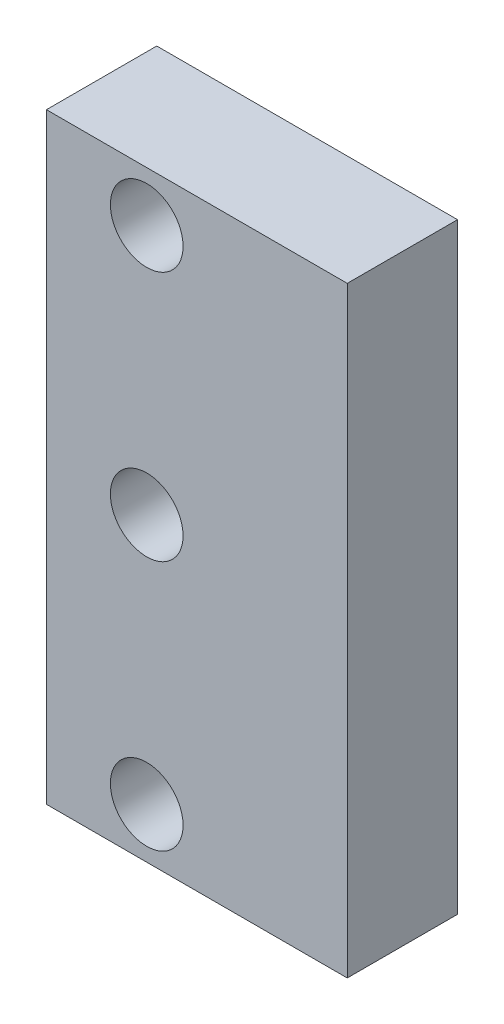
ISO-10303-21;
HEADER;
FILE_DESCRIPTION(('STEP AP214'),'2;1');
FILE_NAME('part.step','',(''),(''),'','','');
FILE_SCHEMA(('AUTOMOTIVE_DESIGN { 1 0 10303 214 1 1 1 1 }'));
ENDSEC;
DATA;
#1=APPLICATION_CONTEXT('core data for automotive mechanical design processes');
#2=APPLICATION_PROTOCOL_DEFINITION('international standard','automotive_design',2000,#1);
#3=PRODUCT_CONTEXT('',#1,'mechanical');
#4=PRODUCT('Part','Part','',(#3));
#5=PRODUCT_RELATED_PRODUCT_CATEGORY('part','',(#4));
#6=PRODUCT_DEFINITION_FORMATION('','',#4);
#7=PRODUCT_DEFINITION_CONTEXT('part definition',#1,'design');
#8=PRODUCT_DEFINITION('design','',#6,#7);
#9=PRODUCT_DEFINITION_SHAPE('','',#8);
#10=(LENGTH_UNIT() NAMED_UNIT(*) SI_UNIT(.MILLI.,.METRE.));
#11=(NAMED_UNIT(*) PLANE_ANGLE_UNIT() SI_UNIT($,.RADIAN.));
#12=(NAMED_UNIT(*) SI_UNIT($,.STERADIAN.) SOLID_ANGLE_UNIT());
#13=UNCERTAINTY_MEASURE_WITH_UNIT(LENGTH_MEASURE(1.E-05),#10,'distance_accuracy_value','');
#14=(GEOMETRIC_REPRESENTATION_CONTEXT(3) GLOBAL_UNCERTAINTY_ASSIGNED_CONTEXT((#13)) GLOBAL_UNIT_ASSIGNED_CONTEXT((#10,
#11,#12)) REPRESENTATION_CONTEXT('',''));
#15=CARTESIAN_POINT('',(0.,0.,0.));
#16=DIRECTION('',(0.,0.,1.));
#17=DIRECTION('',(1.,0.,0.));
#18=AXIS2_PLACEMENT_3D('',#15,#16,#17);
#19=CARTESIAN_POINT('',(0.,0.,11.));
#20=DIRECTION('',(0.,0.,1.));
#21=DIRECTION('',(1.,0.,0.));
#22=AXIS2_PLACEMENT_3D('',#19,#20,#21);
#23=PLANE('',#22);
#24=CARTESIAN_POINT('',(-5.,0.,11.));
#25=DIRECTION('',(0.,0.,1.));
#26=DIRECTION('',(1.,0.,0.));
#27=AXIS2_PLACEMENT_3D('',#24,#25,#26);
#28=CIRCLE('',#27,3.625);
#29=CARTESIAN_POINT('',(-1.375,0.,11.));
#30=VERTEX_POINT('',#29);
#31=EDGE_CURVE('E115',#30,#30,#28,.T.);
#32=ORIENTED_EDGE('',*,*,#31,.F.);
#33=EDGE_LOOP('',(#32));
#34=FACE_BOUND('',#33,.T.);
#35=DIRECTION('',(0.,-1.,0.));
#36=VECTOR('',#35,1.);
#37=CARTESIAN_POINT('',(-15.,-30.,11.));
#38=LINE('',#37,#36);
#39=CARTESIAN_POINT('',(-15.,30.,11.));
#40=VERTEX_POINT('',#39);
#41=CARTESIAN_POINT('',(-15.,-30.,11.));
#42=VERTEX_POINT('',#41);
#43=EDGE_CURVE('E85',#40,#42,#38,.T.);
#44=ORIENTED_EDGE('',*,*,#43,.T.);
#45=DIRECTION('',(1.,0.,0.));
#46=VECTOR('',#45,1.);
#47=CARTESIAN_POINT('',(15.,-30.,11.));
#48=LINE('',#47,#46);
#49=CARTESIAN_POINT('',(15.,-30.,11.));
#50=VERTEX_POINT('',#49);
#51=EDGE_CURVE('E80',#42,#50,#48,.T.);
#52=ORIENTED_EDGE('',*,*,#51,.T.);
#53=DIRECTION('',(0.,1.,0.));
#54=VECTOR('',#53,1.);
#55=CARTESIAN_POINT('',(15.,-30.,11.));
#56=LINE('',#55,#54);
#57=CARTESIAN_POINT('',(15.,30.,11.));
#58=VERTEX_POINT('',#57);
#59=EDGE_CURVE('E83',#50,#58,#56,.T.);
#60=ORIENTED_EDGE('',*,*,#59,.T.);
#61=DIRECTION('',(-1.,0.,0.));
#62=VECTOR('',#61,1.);
#63=CARTESIAN_POINT('',(15.,30.,11.));
#64=LINE('',#63,#62);
#65=EDGE_CURVE('E50',#58,#40,#64,.T.);
#66=ORIENTED_EDGE('',*,*,#65,.T.);
#67=EDGE_LOOP('',(#44,#52,#60,#66));
#68=FACE_BOUND('',#67,.T.);
#69=CARTESIAN_POINT('',(-5.,25.,11.));
#70=DIRECTION('',(0.,0.,1.));
#71=DIRECTION('',(1.,0.,0.));
#72=AXIS2_PLACEMENT_3D('',#69,#70,#71);
#73=CIRCLE('',#72,3.625);
#74=CARTESIAN_POINT('',(-1.375,25.,11.));
#75=VERTEX_POINT('',#74);
#76=EDGE_CURVE('E100',#75,#75,#73,.T.);
#77=ORIENTED_EDGE('',*,*,#76,.F.);
#78=EDGE_LOOP('',(#77));
#79=FACE_BOUND('',#78,.T.);
#80=CARTESIAN_POINT('',(-5.,-25.,11.));
#81=DIRECTION('',(0.,0.,1.));
#82=DIRECTION('',(1.,0.,0.));
#83=AXIS2_PLACEMENT_3D('',#80,#81,#82);
#84=CIRCLE('',#83,3.625);
#85=CARTESIAN_POINT('',(-1.375,-25.,11.));
#86=VERTEX_POINT('',#85);
#87=EDGE_CURVE('E121',#86,#86,#84,.T.);
#88=ORIENTED_EDGE('',*,*,#87,.F.);
#89=EDGE_LOOP('',(#88));
#90=FACE_BOUND('',#89,.T.);
#91=ADVANCED_FACE('F33',(#34,#68,#79,#90),#23,.T.);
#92=CARTESIAN_POINT('',(0.,0.,0.));
#93=DIRECTION('',(0.,0.,1.));
#94=DIRECTION('',(1.,0.,0.));
#95=AXIS2_PLACEMENT_3D('',#92,#93,#94);
#96=PLANE('',#95);
#97=DIRECTION('',(0.,-1.,0.));
#98=VECTOR('',#97,1.);
#99=CARTESIAN_POINT('',(-15.,-30.,0.));
#100=LINE('',#99,#98);
#101=CARTESIAN_POINT('',(-15.,30.,0.));
#102=VERTEX_POINT('',#101);
#103=CARTESIAN_POINT('',(-15.,-30.,0.));
#104=VERTEX_POINT('',#103);
#105=EDGE_CURVE('E97',#102,#104,#100,.T.);
#106=ORIENTED_EDGE('',*,*,#105,.F.);
#107=DIRECTION('',(-1.,0.,0.));
#108=VECTOR('',#107,1.);
#109=CARTESIAN_POINT('',(15.,30.,0.));
#110=LINE('',#109,#108);
#111=CARTESIAN_POINT('',(15.,30.,0.));
#112=VERTEX_POINT('',#111);
#113=EDGE_CURVE('E73',#112,#102,#110,.T.);
#114=ORIENTED_EDGE('',*,*,#113,.F.);
#115=DIRECTION('',(0.,1.,0.));
#116=VECTOR('',#115,1.);
#117=CARTESIAN_POINT('',(15.,-30.,0.));
#118=LINE('',#117,#116);
#119=CARTESIAN_POINT('',(15.,-30.,0.));
#120=VERTEX_POINT('',#119);
#121=EDGE_CURVE('E67',#120,#112,#118,.T.);
#122=ORIENTED_EDGE('',*,*,#121,.F.);
#123=DIRECTION('',(1.,0.,0.));
#124=VECTOR('',#123,1.);
#125=CARTESIAN_POINT('',(15.,-30.,0.));
#126=LINE('',#125,#124);
#127=EDGE_CURVE('E89',#104,#120,#126,.T.);
#128=ORIENTED_EDGE('',*,*,#127,.F.);
#129=EDGE_LOOP('',(#106,#114,#122,#128));
#130=FACE_BOUND('',#129,.T.);
#131=CARTESIAN_POINT('',(-5.,25.,0.));
#132=DIRECTION('',(0.,0.,1.));
#133=DIRECTION('',(1.,0.,0.));
#134=AXIS2_PLACEMENT_3D('',#131,#132,#133);
#135=CIRCLE('',#134,3.625);
#136=CARTESIAN_POINT('',(-1.375,25.,0.));
#137=VERTEX_POINT('',#136);
#138=EDGE_CURVE('E112',#137,#137,#135,.T.);
#139=ORIENTED_EDGE('',*,*,#138,.T.);
#140=EDGE_LOOP('',(#139));
#141=FACE_BOUND('',#140,.T.);
#142=CARTESIAN_POINT('',(-5.,0.,0.));
#143=DIRECTION('',(0.,0.,1.));
#144=DIRECTION('',(1.,0.,0.));
#145=AXIS2_PLACEMENT_3D('',#142,#143,#144);
#146=CIRCLE('',#145,3.625);
#147=CARTESIAN_POINT('',(-1.375,0.,0.));
#148=VERTEX_POINT('',#147);
#149=EDGE_CURVE('E118',#148,#148,#146,.T.);
#150=ORIENTED_EDGE('',*,*,#149,.T.);
#151=EDGE_LOOP('',(#150));
#152=FACE_BOUND('',#151,.T.);
#153=CARTESIAN_POINT('',(-5.,-25.,0.));
#154=DIRECTION('',(0.,0.,1.));
#155=DIRECTION('',(1.,0.,0.));
#156=AXIS2_PLACEMENT_3D('',#153,#154,#155);
#157=CIRCLE('',#156,3.625);
#158=CARTESIAN_POINT('',(-1.375,-25.,0.));
#159=VERTEX_POINT('',#158);
#160=EDGE_CURVE('E124',#159,#159,#157,.T.);
#161=ORIENTED_EDGE('',*,*,#160,.T.);
#162=EDGE_LOOP('',(#161));
#163=FACE_BOUND('',#162,.T.);
#164=ADVANCED_FACE('F108',(#130,#141,#152,#163),#96,.F.);
#165=CARTESIAN_POINT('',(-15.,-30.,11.));
#166=DIRECTION('',(1.,0.,0.));
#167=DIRECTION('',(0.,0.,-1.));
#168=AXIS2_PLACEMENT_3D('',#165,#166,#167);
#169=PLANE('',#168);
#170=ORIENTED_EDGE('',*,*,#105,.T.);
#171=DIRECTION('',(0.,0.,-1.));
#172=VECTOR('',#171,1.);
#173=CARTESIAN_POINT('',(-15.,-30.,11.));
#174=LINE('',#173,#172);
#175=EDGE_CURVE('E11',#42,#104,#174,.T.);
#176=ORIENTED_EDGE('',*,*,#175,.F.);
#177=ORIENTED_EDGE('',*,*,#43,.F.);
#178=DIRECTION('',(0.,0.,-1.));
#179=VECTOR('',#178,1.);
#180=CARTESIAN_POINT('',(-15.,30.,11.));
#181=LINE('',#180,#179);
#182=EDGE_CURVE('E93',#40,#102,#181,.T.);
#183=ORIENTED_EDGE('',*,*,#182,.T.);
#184=EDGE_LOOP('',(#170,#176,#177,#183));
#185=FACE_BOUND('',#184,.T.);
#186=ADVANCED_FACE('F35',(#185),#169,.F.);
#187=CARTESIAN_POINT('',(15.,-30.,11.));
#188=DIRECTION('',(0.,1.,0.));
#189=DIRECTION('',(0.,0.,1.));
#190=AXIS2_PLACEMENT_3D('',#187,#188,#189);
#191=PLANE('',#190);
#192=ORIENTED_EDGE('',*,*,#127,.T.);
#193=DIRECTION('',(0.,0.,-1.));
#194=VECTOR('',#193,1.);
#195=CARTESIAN_POINT('',(15.,-30.,11.));
#196=LINE('',#195,#194);
#197=EDGE_CURVE('E42',#50,#120,#196,.T.);
#198=ORIENTED_EDGE('',*,*,#197,.F.);
#199=ORIENTED_EDGE('',*,*,#51,.F.);
#200=ORIENTED_EDGE('',*,*,#175,.T.);
#201=EDGE_LOOP('',(#192,#198,#199,#200));
#202=FACE_BOUND('',#201,.T.);
#203=ADVANCED_FACE('F88',(#202),#191,.F.);
#204=CARTESIAN_POINT('',(15.,-30.,11.));
#205=DIRECTION('',(-1.,0.,0.));
#206=DIRECTION('',(0.,0.,1.));
#207=AXIS2_PLACEMENT_3D('',#204,#205,#206);
#208=PLANE('',#207);
#209=ORIENTED_EDGE('',*,*,#121,.T.);
#210=DIRECTION('',(0.,0.,-1.));
#211=VECTOR('',#210,1.);
#212=CARTESIAN_POINT('',(15.,30.,11.));
#213=LINE('',#212,#211);
#214=EDGE_CURVE('E90',#58,#112,#213,.T.);
#215=ORIENTED_EDGE('',*,*,#214,.F.);
#216=ORIENTED_EDGE('',*,*,#59,.F.);
#217=ORIENTED_EDGE('',*,*,#197,.T.);
#218=EDGE_LOOP('',(#209,#215,#216,#217));
#219=FACE_BOUND('',#218,.T.);
#220=ADVANCED_FACE('F91',(#219),#208,.F.);
#221=CARTESIAN_POINT('',(15.,30.,11.));
#222=DIRECTION('',(0.,-1.,0.));
#223=DIRECTION('',(0.,0.,-1.));
#224=AXIS2_PLACEMENT_3D('',#221,#222,#223);
#225=PLANE('',#224);
#226=ORIENTED_EDGE('',*,*,#113,.T.);
#227=ORIENTED_EDGE('',*,*,#182,.F.);
#228=ORIENTED_EDGE('',*,*,#65,.F.);
#229=ORIENTED_EDGE('',*,*,#214,.T.);
#230=EDGE_LOOP('',(#226,#227,#228,#229));
#231=FACE_BOUND('',#230,.T.);
#232=ADVANCED_FACE('F105',(#231),#225,.F.);
#233=CARTESIAN_POINT('',(-5.,25.,11.));
#234=DIRECTION('',(0.,0.,-1.));
#235=DIRECTION('',(-1.,0.,0.));
#236=AXIS2_PLACEMENT_3D('',#233,#234,#235);
#237=CYLINDRICAL_SURFACE('',#236,3.625);
#238=ORIENTED_EDGE('',*,*,#76,.T.);
#239=EDGE_LOOP('',(#238));
#240=FACE_BOUND('',#239,.T.);
#241=ORIENTED_EDGE('',*,*,#138,.F.);
#242=EDGE_LOOP('',(#241));
#243=FACE_BOUND('',#242,.T.);
#244=ADVANCED_FACE('F142',(#240,#243),#237,.F.);
#245=CARTESIAN_POINT('',(-5.,0.,11.));
#246=DIRECTION('',(0.,0.,-1.));
#247=DIRECTION('',(-1.,0.,0.));
#248=AXIS2_PLACEMENT_3D('',#245,#246,#247);
#249=CYLINDRICAL_SURFACE('',#248,3.625);
#250=ORIENTED_EDGE('',*,*,#31,.T.);
#251=EDGE_LOOP('',(#250));
#252=FACE_BOUND('',#251,.T.);
#253=ORIENTED_EDGE('',*,*,#149,.F.);
#254=EDGE_LOOP('',(#253));
#255=FACE_BOUND('',#254,.T.);
#256=ADVANCED_FACE('F188',(#252,#255),#249,.F.);
#257=CARTESIAN_POINT('',(-5.,-25.,11.));
#258=DIRECTION('',(0.,0.,-1.));
#259=DIRECTION('',(-1.,0.,0.));
#260=AXIS2_PLACEMENT_3D('',#257,#258,#259);
#261=CYLINDRICAL_SURFACE('',#260,3.625);
#262=ORIENTED_EDGE('',*,*,#87,.T.);
#263=EDGE_LOOP('',(#262));
#264=FACE_BOUND('',#263,.T.);
#265=ORIENTED_EDGE('',*,*,#160,.F.);
#266=EDGE_LOOP('',(#265));
#267=FACE_BOUND('',#266,.T.);
#268=ADVANCED_FACE('F130',(#264,#267),#261,.F.);
#269=CLOSED_SHELL('',(#91,#164,#186,#203,#220,#232,#244,#256,#268));
#270=MANIFOLD_SOLID_BREP('B2',#269);
#271=ADVANCED_BREP_SHAPE_REPRESENTATION('',(#18,#270),#14);
#272=SHAPE_DEFINITION_REPRESENTATION(#9,#271);
ENDSEC;
END-ISO-10303-21;
